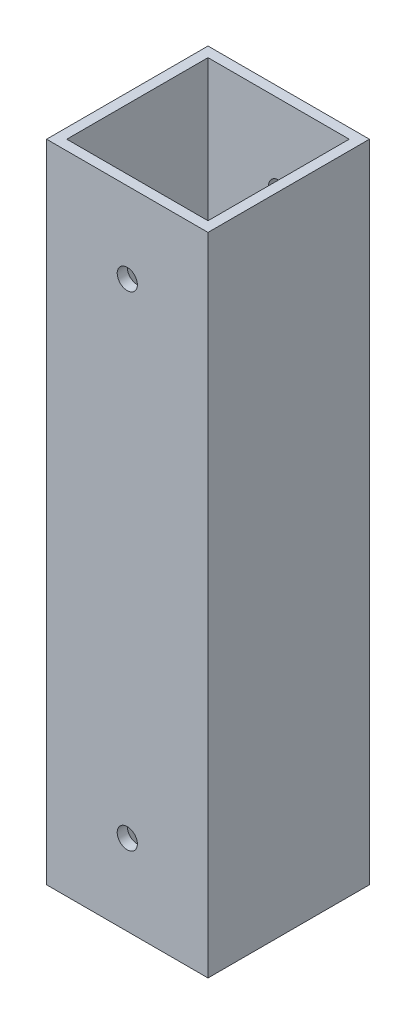
ISO-10303-21;
HEADER;
FILE_DESCRIPTION(('STEP AP214'),'2;1');
FILE_NAME('part.step','',(''),(''),'','','');
FILE_SCHEMA(('AUTOMOTIVE_DESIGN { 1 0 10303 214 1 1 1 1 }'));
ENDSEC;
DATA;
#1=APPLICATION_CONTEXT('core data for automotive mechanical design processes');
#2=APPLICATION_PROTOCOL_DEFINITION('international standard','automotive_design',2000,#1);
#3=PRODUCT_CONTEXT('',#1,'mechanical');
#4=PRODUCT('Part','Part','',(#3));
#5=PRODUCT_RELATED_PRODUCT_CATEGORY('part','',(#4));
#6=PRODUCT_DEFINITION_FORMATION('','',#4);
#7=PRODUCT_DEFINITION_CONTEXT('part definition',#1,'design');
#8=PRODUCT_DEFINITION('design','',#6,#7);
#9=PRODUCT_DEFINITION_SHAPE('','',#8);
#10=(LENGTH_UNIT() NAMED_UNIT(*) SI_UNIT(.MILLI.,.METRE.));
#11=(NAMED_UNIT(*) PLANE_ANGLE_UNIT() SI_UNIT($,.RADIAN.));
#12=(NAMED_UNIT(*) SI_UNIT($,.STERADIAN.) SOLID_ANGLE_UNIT());
#13=UNCERTAINTY_MEASURE_WITH_UNIT(LENGTH_MEASURE(1.E-05),#10,'distance_accuracy_value','');
#14=(GEOMETRIC_REPRESENTATION_CONTEXT(3) GLOBAL_UNCERTAINTY_ASSIGNED_CONTEXT((#13)) GLOBAL_UNIT_ASSIGNED_CONTEXT((#10,
#11,#12)) REPRESENTATION_CONTEXT('',''));
#15=CARTESIAN_POINT('',(0.,0.,0.));
#16=DIRECTION('',(0.,0.,1.));
#17=DIRECTION('',(1.,0.,0.));
#18=AXIS2_PLACEMENT_3D('',#15,#16,#17);
#19=CARTESIAN_POINT('',(0.,101.6,0.));
#20=DIRECTION('',(0.,-1.,0.));
#21=DIRECTION('',(0.,0.,-1.));
#22=AXIS2_PLACEMENT_3D('',#19,#20,#21);
#23=PLANE('',#22);
#24=DIRECTION('',(0.,0.,-1.));
#25=VECTOR('',#24,1.);
#26=CARTESIAN_POINT('',(12.7,101.6,12.7));
#27=LINE('',#26,#25);
#28=CARTESIAN_POINT('',(12.7,101.6,12.7));
#29=VERTEX_POINT('',#28);
#30=CARTESIAN_POINT('',(12.7,101.6,-12.7));
#31=VERTEX_POINT('',#30);
#32=EDGE_CURVE('E139',#29,#31,#27,.T.);
#33=ORIENTED_EDGE('',*,*,#32,.T.);
#34=DIRECTION('',(-1.,0.,0.));
#35=VECTOR('',#34,1.);
#36=CARTESIAN_POINT('',(-12.7,101.6,-12.7));
#37=LINE('',#36,#35);
#38=CARTESIAN_POINT('',(-12.7,101.6,-12.7));
#39=VERTEX_POINT('',#38);
#40=EDGE_CURVE('E142',#31,#39,#37,.T.);
#41=ORIENTED_EDGE('',*,*,#40,.T.);
#42=DIRECTION('',(0.,0.,1.));
#43=VECTOR('',#42,1.);
#44=CARTESIAN_POINT('',(-12.7,101.6,12.7));
#45=LINE('',#44,#43);
#46=CARTESIAN_POINT('',(-12.7,101.6,12.7));
#47=VERTEX_POINT('',#46);
#48=EDGE_CURVE('E145',#39,#47,#45,.T.);
#49=ORIENTED_EDGE('',*,*,#48,.T.);
#50=DIRECTION('',(1.,0.,0.));
#51=VECTOR('',#50,1.);
#52=CARTESIAN_POINT('',(-12.7,101.6,12.7));
#53=LINE('',#52,#51);
#54=EDGE_CURVE('E147',#47,#29,#53,.T.);
#55=ORIENTED_EDGE('',*,*,#54,.T.);
#56=EDGE_LOOP('',(#33,#41,#49,#55));
#57=FACE_BOUND('',#56,.T.);
#58=DIRECTION('',(0.,0.,-1.));
#59=VECTOR('',#58,1.);
#60=CARTESIAN_POINT('',(11.1125,101.6,11.1125));
#61=LINE('',#60,#59);
#62=CARTESIAN_POINT('',(11.1125,101.6,11.1125));
#63=VERTEX_POINT('',#62);
#64=CARTESIAN_POINT('',(11.1125,101.6,-11.1125));
#65=VERTEX_POINT('',#64);
#66=EDGE_CURVE('E101',#63,#65,#61,.T.);
#67=ORIENTED_EDGE('',*,*,#66,.F.);
#68=DIRECTION('',(1.,0.,0.));
#69=VECTOR('',#68,1.);
#70=CARTESIAN_POINT('',(-11.1125,101.6,11.1125));
#71=LINE('',#70,#69);
#72=CARTESIAN_POINT('',(-11.1125,101.6,11.1125));
#73=VERTEX_POINT('',#72);
#74=EDGE_CURVE('E123',#73,#63,#71,.T.);
#75=ORIENTED_EDGE('',*,*,#74,.F.);
#76=DIRECTION('',(0.,0.,1.));
#77=VECTOR('',#76,1.);
#78=CARTESIAN_POINT('',(-11.1125,101.6,11.1125));
#79=LINE('',#78,#77);
#80=CARTESIAN_POINT('',(-11.1125,101.6,-11.1125));
#81=VERTEX_POINT('',#80);
#82=EDGE_CURVE('E121',#81,#73,#79,.T.);
#83=ORIENTED_EDGE('',*,*,#82,.F.);
#84=DIRECTION('',(-1.,0.,0.));
#85=VECTOR('',#84,1.);
#86=CARTESIAN_POINT('',(-11.1125,101.6,-11.1125));
#87=LINE('',#86,#85);
#88=EDGE_CURVE('E109',#65,#81,#87,.T.);
#89=ORIENTED_EDGE('',*,*,#88,.F.);
#90=EDGE_LOOP('',(#67,#75,#83,#89));
#91=FACE_BOUND('',#90,.T.);
#92=ADVANCED_FACE('F34',(#57,#91),#23,.F.);
#93=CARTESIAN_POINT('',(0.,0.,0.));
#94=DIRECTION('',(0.,-1.,0.));
#95=DIRECTION('',(0.,0.,-1.));
#96=AXIS2_PLACEMENT_3D('',#93,#94,#95);
#97=PLANE('',#96);
#98=DIRECTION('',(0.,0.,-1.));
#99=VECTOR('',#98,1.);
#100=CARTESIAN_POINT('',(12.7,0.,12.7));
#101=LINE('',#100,#99);
#102=CARTESIAN_POINT('',(12.7,0.,12.7));
#103=VERTEX_POINT('',#102);
#104=CARTESIAN_POINT('',(12.7,0.,-12.7));
#105=VERTEX_POINT('',#104);
#106=EDGE_CURVE('E117',#103,#105,#101,.T.);
#107=ORIENTED_EDGE('',*,*,#106,.F.);
#108=DIRECTION('',(1.,0.,0.));
#109=VECTOR('',#108,1.);
#110=CARTESIAN_POINT('',(-12.7,0.,12.7));
#111=LINE('',#110,#109);
#112=CARTESIAN_POINT('',(-12.7,0.,12.7));
#113=VERTEX_POINT('',#112);
#114=EDGE_CURVE('E143',#113,#103,#111,.T.);
#115=ORIENTED_EDGE('',*,*,#114,.F.);
#116=DIRECTION('',(0.,0.,1.));
#117=VECTOR('',#116,1.);
#118=CARTESIAN_POINT('',(-12.7,0.,12.7));
#119=LINE('',#118,#117);
#120=CARTESIAN_POINT('',(-12.7,0.,-12.7));
#121=VERTEX_POINT('',#120);
#122=EDGE_CURVE('E154',#121,#113,#119,.T.);
#123=ORIENTED_EDGE('',*,*,#122,.F.);
#124=DIRECTION('',(-1.,0.,0.));
#125=VECTOR('',#124,1.);
#126=CARTESIAN_POINT('',(-12.7,0.,-12.7));
#127=LINE('',#126,#125);
#128=EDGE_CURVE('E152',#105,#121,#127,.T.);
#129=ORIENTED_EDGE('',*,*,#128,.F.);
#130=EDGE_LOOP('',(#107,#115,#123,#129));
#131=FACE_BOUND('',#130,.T.);
#132=DIRECTION('',(1.,0.,0.));
#133=VECTOR('',#132,1.);
#134=CARTESIAN_POINT('',(-11.1125,0.,11.1125));
#135=LINE('',#134,#133);
#136=CARTESIAN_POINT('',(-11.1125,0.,11.1125));
#137=VERTEX_POINT('',#136);
#138=CARTESIAN_POINT('',(11.1125,0.,11.1125));
#139=VERTEX_POINT('',#138);
#140=EDGE_CURVE('E110',#137,#139,#135,.T.);
#141=ORIENTED_EDGE('',*,*,#140,.T.);
#142=DIRECTION('',(0.,0.,-1.));
#143=VECTOR('',#142,1.);
#144=CARTESIAN_POINT('',(11.1125,0.,11.1125));
#145=LINE('',#144,#143);
#146=CARTESIAN_POINT('',(11.1125,0.,-11.1125));
#147=VERTEX_POINT('',#146);
#148=EDGE_CURVE('E59',#139,#147,#145,.T.);
#149=ORIENTED_EDGE('',*,*,#148,.T.);
#150=DIRECTION('',(-1.,0.,0.));
#151=VECTOR('',#150,1.);
#152=CARTESIAN_POINT('',(-11.1125,0.,-11.1125));
#153=LINE('',#152,#151);
#154=CARTESIAN_POINT('',(-11.1125,0.,-11.1125));
#155=VERTEX_POINT('',#154);
#156=EDGE_CURVE('E116',#147,#155,#153,.T.);
#157=ORIENTED_EDGE('',*,*,#156,.T.);
#158=DIRECTION('',(0.,0.,1.));
#159=VECTOR('',#158,1.);
#160=CARTESIAN_POINT('',(-11.1125,0.,11.1125));
#161=LINE('',#160,#159);
#162=EDGE_CURVE('E131',#155,#137,#161,.T.);
#163=ORIENTED_EDGE('',*,*,#162,.T.);
#164=EDGE_LOOP('',(#141,#149,#157,#163));
#165=FACE_BOUND('',#164,.T.);
#166=ADVANCED_FACE('F200',(#131,#165),#97,.T.);
#167=CARTESIAN_POINT('',(12.7,101.6,12.7));
#168=DIRECTION('',(-1.,0.,0.));
#169=DIRECTION('',(0.,0.,1.));
#170=AXIS2_PLACEMENT_3D('',#167,#168,#169);
#171=PLANE('',#170);
#172=ORIENTED_EDGE('',*,*,#106,.T.);
#173=DIRECTION('',(0.,-1.,0.));
#174=VECTOR('',#173,1.);
#175=CARTESIAN_POINT('',(12.7,101.6,-12.7));
#176=LINE('',#175,#174);
#177=EDGE_CURVE('E11',#31,#105,#176,.T.);
#178=ORIENTED_EDGE('',*,*,#177,.F.);
#179=ORIENTED_EDGE('',*,*,#32,.F.);
#180=DIRECTION('',(0.,-1.,0.));
#181=VECTOR('',#180,1.);
#182=CARTESIAN_POINT('',(12.7,101.6,12.7));
#183=LINE('',#182,#181);
#184=EDGE_CURVE('E149',#29,#103,#183,.T.);
#185=ORIENTED_EDGE('',*,*,#184,.T.);
#186=EDGE_LOOP('',(#172,#178,#179,#185));
#187=FACE_BOUND('',#186,.T.);
#188=ADVANCED_FACE('F36',(#187),#171,.F.);
#189=CARTESIAN_POINT('',(-12.7,101.6,-12.7));
#190=DIRECTION('',(0.,0.,1.));
#191=DIRECTION('',(1.,0.,0.));
#192=AXIS2_PLACEMENT_3D('',#189,#190,#191);
#193=PLANE('',#192);
#194=CARTESIAN_POINT('',(0.,88.9,-12.7));
#195=DIRECTION('',(0.,0.,-1.));
#196=DIRECTION('',(-1.,0.,0.));
#197=AXIS2_PLACEMENT_3D('',#194,#195,#196);
#198=CIRCLE('',#197,1.5875);
#199=CARTESIAN_POINT('',(-1.5875,88.9,-12.7));
#200=VERTEX_POINT('',#199);
#201=EDGE_CURVE('E172',#200,#200,#198,.T.);
#202=ORIENTED_EDGE('',*,*,#201,.F.);
#203=EDGE_LOOP('',(#202));
#204=FACE_BOUND('',#203,.T.);
#205=CARTESIAN_POINT('',(0.,12.7,-12.7));
#206=DIRECTION('',(0.,0.,-1.));
#207=DIRECTION('',(-1.,0.,0.));
#208=AXIS2_PLACEMENT_3D('',#205,#206,#207);
#209=CIRCLE('',#208,1.5875);
#210=CARTESIAN_POINT('',(-1.5875,12.7,-12.7));
#211=VERTEX_POINT('',#210);
#212=EDGE_CURVE('E180',#211,#211,#209,.T.);
#213=ORIENTED_EDGE('',*,*,#212,.F.);
#214=EDGE_LOOP('',(#213));
#215=FACE_BOUND('',#214,.T.);
#216=ORIENTED_EDGE('',*,*,#128,.T.);
#217=DIRECTION('',(0.,-1.,0.));
#218=VECTOR('',#217,1.);
#219=CARTESIAN_POINT('',(-12.7,101.6,-12.7));
#220=LINE('',#219,#218);
#221=EDGE_CURVE('E43',#39,#121,#220,.T.);
#222=ORIENTED_EDGE('',*,*,#221,.F.);
#223=ORIENTED_EDGE('',*,*,#40,.F.);
#224=ORIENTED_EDGE('',*,*,#177,.T.);
#225=EDGE_LOOP('',(#216,#222,#223,#224));
#226=FACE_BOUND('',#225,.T.);
#227=ADVANCED_FACE('F225',(#204,#215,#226),#193,.F.);
#228=CARTESIAN_POINT('',(-12.7,101.6,12.7));
#229=DIRECTION('',(1.,0.,0.));
#230=DIRECTION('',(0.,0.,-1.));
#231=AXIS2_PLACEMENT_3D('',#228,#229,#230);
#232=PLANE('',#231);
#233=ORIENTED_EDGE('',*,*,#122,.T.);
#234=DIRECTION('',(0.,-1.,0.));
#235=VECTOR('',#234,1.);
#236=CARTESIAN_POINT('',(-12.7,101.6,12.7));
#237=LINE('',#236,#235);
#238=EDGE_CURVE('E159',#47,#113,#237,.T.);
#239=ORIENTED_EDGE('',*,*,#238,.F.);
#240=ORIENTED_EDGE('',*,*,#48,.F.);
#241=ORIENTED_EDGE('',*,*,#221,.T.);
#242=EDGE_LOOP('',(#233,#239,#240,#241));
#243=FACE_BOUND('',#242,.T.);
#244=ADVANCED_FACE('F222',(#243),#232,.F.);
#245=CARTESIAN_POINT('',(-12.7,101.6,12.7));
#246=DIRECTION('',(0.,0.,-1.));
#247=DIRECTION('',(-1.,0.,0.));
#248=AXIS2_PLACEMENT_3D('',#245,#246,#247);
#249=PLANE('',#248);
#250=CARTESIAN_POINT('',(0.,88.9,12.7));
#251=DIRECTION('',(0.,0.,-1.));
#252=DIRECTION('',(-1.,0.,0.));
#253=AXIS2_PLACEMENT_3D('',#250,#251,#252);
#254=CIRCLE('',#253,1.5875);
#255=CARTESIAN_POINT('',(-1.5875,88.9,12.7));
#256=VERTEX_POINT('',#255);
#257=EDGE_CURVE('E166',#256,#256,#254,.F.);
#258=ORIENTED_EDGE('',*,*,#257,.F.);
#259=EDGE_LOOP('',(#258));
#260=FACE_BOUND('',#259,.T.);
#261=CARTESIAN_POINT('',(0.,12.7,12.7));
#262=DIRECTION('',(0.,0.,-1.));
#263=DIRECTION('',(-1.,0.,0.));
#264=AXIS2_PLACEMENT_3D('',#261,#262,#263);
#265=CIRCLE('',#264,1.5875);
#266=CARTESIAN_POINT('',(-1.5875,12.7,12.7));
#267=VERTEX_POINT('',#266);
#268=EDGE_CURVE('E177',#267,#267,#265,.F.);
#269=ORIENTED_EDGE('',*,*,#268,.F.);
#270=EDGE_LOOP('',(#269));
#271=FACE_BOUND('',#270,.T.);
#272=ORIENTED_EDGE('',*,*,#114,.T.);
#273=ORIENTED_EDGE('',*,*,#184,.F.);
#274=ORIENTED_EDGE('',*,*,#54,.F.);
#275=ORIENTED_EDGE('',*,*,#238,.T.);
#276=EDGE_LOOP('',(#272,#273,#274,#275));
#277=FACE_BOUND('',#276,.T.);
#278=ADVANCED_FACE('F219',(#260,#271,#277),#249,.F.);
#279=CARTESIAN_POINT('',(11.1125,101.6,11.1125));
#280=DIRECTION('',(-1.,0.,0.));
#281=DIRECTION('',(0.,0.,1.));
#282=AXIS2_PLACEMENT_3D('',#279,#280,#281);
#283=PLANE('',#282);
#284=ORIENTED_EDGE('',*,*,#148,.F.);
#285=DIRECTION('',(0.,-1.,0.));
#286=VECTOR('',#285,1.);
#287=CARTESIAN_POINT('',(11.1125,101.6,11.1125));
#288=LINE('',#287,#286);
#289=EDGE_CURVE('E105',#63,#139,#288,.T.);
#290=ORIENTED_EDGE('',*,*,#289,.F.);
#291=ORIENTED_EDGE('',*,*,#66,.T.);
#292=DIRECTION('',(0.,-1.,0.));
#293=VECTOR('',#292,1.);
#294=CARTESIAN_POINT('',(11.1125,101.6,-11.1125));
#295=LINE('',#294,#293);
#296=EDGE_CURVE('E104',#65,#147,#295,.T.);
#297=ORIENTED_EDGE('',*,*,#296,.T.);
#298=EDGE_LOOP('',(#284,#290,#291,#297));
#299=FACE_BOUND('',#298,.T.);
#300=ADVANCED_FACE('F103',(#299),#283,.T.);
#301=CARTESIAN_POINT('',(-11.1125,101.6,-11.1125));
#302=DIRECTION('',(0.,0.,1.));
#303=DIRECTION('',(1.,0.,0.));
#304=AXIS2_PLACEMENT_3D('',#301,#302,#303);
#305=PLANE('',#304);
#306=CARTESIAN_POINT('',(0.,88.9,-11.1125));
#307=DIRECTION('',(0.,0.,1.));
#308=DIRECTION('',(1.,0.,0.));
#309=AXIS2_PLACEMENT_3D('',#306,#307,#308);
#310=CIRCLE('',#309,1.5875);
#311=CARTESIAN_POINT('',(1.5875,88.9,-11.1125));
#312=VERTEX_POINT('',#311);
#313=EDGE_CURVE('E129',#312,#312,#310,.T.);
#314=ORIENTED_EDGE('',*,*,#313,.F.);
#315=EDGE_LOOP('',(#314));
#316=FACE_BOUND('',#315,.T.);
#317=CARTESIAN_POINT('',(0.,12.7,-11.1125));
#318=DIRECTION('',(0.,0.,1.));
#319=DIRECTION('',(1.,0.,0.));
#320=AXIS2_PLACEMENT_3D('',#317,#318,#319);
#321=CIRCLE('',#320,1.5875);
#322=CARTESIAN_POINT('',(1.5875,12.7,-11.1125));
#323=VERTEX_POINT('',#322);
#324=EDGE_CURVE('E165',#323,#323,#321,.T.);
#325=ORIENTED_EDGE('',*,*,#324,.F.);
#326=EDGE_LOOP('',(#325));
#327=FACE_BOUND('',#326,.T.);
#328=ORIENTED_EDGE('',*,*,#156,.F.);
#329=ORIENTED_EDGE('',*,*,#296,.F.);
#330=ORIENTED_EDGE('',*,*,#88,.T.);
#331=DIRECTION('',(0.,-1.,0.));
#332=VECTOR('',#331,1.);
#333=CARTESIAN_POINT('',(-11.1125,101.6,-11.1125));
#334=LINE('',#333,#332);
#335=EDGE_CURVE('E118',#81,#155,#334,.T.);
#336=ORIENTED_EDGE('',*,*,#335,.T.);
#337=EDGE_LOOP('',(#328,#329,#330,#336));
#338=FACE_BOUND('',#337,.T.);
#339=ADVANCED_FACE('F113',(#316,#327,#338),#305,.T.);
#340=CARTESIAN_POINT('',(-11.1125,101.6,11.1125));
#341=DIRECTION('',(1.,0.,0.));
#342=DIRECTION('',(0.,0.,-1.));
#343=AXIS2_PLACEMENT_3D('',#340,#341,#342);
#344=PLANE('',#343);
#345=ORIENTED_EDGE('',*,*,#162,.F.);
#346=ORIENTED_EDGE('',*,*,#335,.F.);
#347=ORIENTED_EDGE('',*,*,#82,.T.);
#348=DIRECTION('',(0.,-1.,0.));
#349=VECTOR('',#348,1.);
#350=CARTESIAN_POINT('',(-11.1125,101.6,11.1125));
#351=LINE('',#350,#349);
#352=EDGE_CURVE('E51',#73,#137,#351,.T.);
#353=ORIENTED_EDGE('',*,*,#352,.T.);
#354=EDGE_LOOP('',(#345,#346,#347,#353));
#355=FACE_BOUND('',#354,.T.);
#356=ADVANCED_FACE('F196',(#355),#344,.T.);
#357=CARTESIAN_POINT('',(-11.1125,101.6,11.1125));
#358=DIRECTION('',(0.,0.,-1.));
#359=DIRECTION('',(-1.,0.,0.));
#360=AXIS2_PLACEMENT_3D('',#357,#358,#359);
#361=PLANE('',#360);
#362=CARTESIAN_POINT('',(0.,88.9,11.1125));
#363=DIRECTION('',(0.,0.,-1.));
#364=DIRECTION('',(-1.,0.,0.));
#365=AXIS2_PLACEMENT_3D('',#362,#363,#364);
#366=CIRCLE('',#365,1.5875);
#367=CARTESIAN_POINT('',(-1.5875,88.9,11.1125));
#368=VERTEX_POINT('',#367);
#369=EDGE_CURVE('E38',#368,#368,#366,.T.);
#370=ORIENTED_EDGE('',*,*,#369,.F.);
#371=EDGE_LOOP('',(#370));
#372=FACE_BOUND('',#371,.T.);
#373=CARTESIAN_POINT('',(0.,12.7,11.1125));
#374=DIRECTION('',(0.,0.,-1.));
#375=DIRECTION('',(-1.,0.,0.));
#376=AXIS2_PLACEMENT_3D('',#373,#374,#375);
#377=CIRCLE('',#376,1.5875);
#378=CARTESIAN_POINT('',(-1.5875,12.7,11.1125));
#379=VERTEX_POINT('',#378);
#380=EDGE_CURVE('E163',#379,#379,#377,.T.);
#381=ORIENTED_EDGE('',*,*,#380,.F.);
#382=EDGE_LOOP('',(#381));
#383=FACE_BOUND('',#382,.T.);
#384=ORIENTED_EDGE('',*,*,#140,.F.);
#385=ORIENTED_EDGE('',*,*,#352,.F.);
#386=ORIENTED_EDGE('',*,*,#74,.T.);
#387=ORIENTED_EDGE('',*,*,#289,.T.);
#388=EDGE_LOOP('',(#384,#385,#386,#387));
#389=FACE_BOUND('',#388,.T.);
#390=ADVANCED_FACE('F192',(#372,#383,#389),#361,.T.);
#391=CARTESIAN_POINT('',(0.,12.7,17.1901280605346));
#392=DIRECTION('',(0.,0.,-1.));
#393=DIRECTION('',(-1.,0.,0.));
#394=AXIS2_PLACEMENT_3D('',#391,#392,#393);
#395=CYLINDRICAL_SURFACE('',#394,1.5875);
#396=ORIENTED_EDGE('',*,*,#380,.T.);
#397=EDGE_LOOP('',(#396));
#398=FACE_BOUND('',#397,.T.);
#399=ORIENTED_EDGE('',*,*,#268,.T.);
#400=EDGE_LOOP('',(#399));
#401=FACE_BOUND('',#400,.T.);
#402=ADVANCED_FACE('F195',(#398,#401),#395,.F.);
#403=CARTESIAN_POINT('',(0.,88.9,17.1901280605346));
#404=DIRECTION('',(0.,0.,-1.));
#405=DIRECTION('',(-1.,0.,0.));
#406=AXIS2_PLACEMENT_3D('',#403,#404,#405);
#407=CYLINDRICAL_SURFACE('',#406,1.5875);
#408=ORIENTED_EDGE('',*,*,#369,.T.);
#409=EDGE_LOOP('',(#408));
#410=FACE_BOUND('',#409,.T.);
#411=ORIENTED_EDGE('',*,*,#257,.T.);
#412=EDGE_LOOP('',(#411));
#413=FACE_BOUND('',#412,.T.);
#414=ADVANCED_FACE('F190',(#410,#413),#407,.F.);
#415=ORIENTED_EDGE('',*,*,#324,.T.);
#416=EDGE_LOOP('',(#415));
#417=FACE_BOUND('',#416,.T.);
#418=ORIENTED_EDGE('',*,*,#212,.T.);
#419=EDGE_LOOP('',(#418));
#420=FACE_BOUND('',#419,.T.);
#421=ADVANCED_FACE('F249',(#417,#420),#395,.F.);
#422=ORIENTED_EDGE('',*,*,#313,.T.);
#423=EDGE_LOOP('',(#422));
#424=FACE_BOUND('',#423,.T.);
#425=ORIENTED_EDGE('',*,*,#201,.T.);
#426=EDGE_LOOP('',(#425));
#427=FACE_BOUND('',#426,.T.);
#428=ADVANCED_FACE('F251',(#424,#427),#407,.F.);
#429=CLOSED_SHELL('',(#92,#166,#188,#227,#244,#278,#300,#339,#356,#390,#402,#414,#421,#428));
#430=MANIFOLD_SOLID_BREP('B2',#429);
#431=ADVANCED_BREP_SHAPE_REPRESENTATION('',(#18,#430),#14);
#432=SHAPE_DEFINITION_REPRESENTATION(#9,#431);
ENDSEC;
END-ISO-10303-21;
